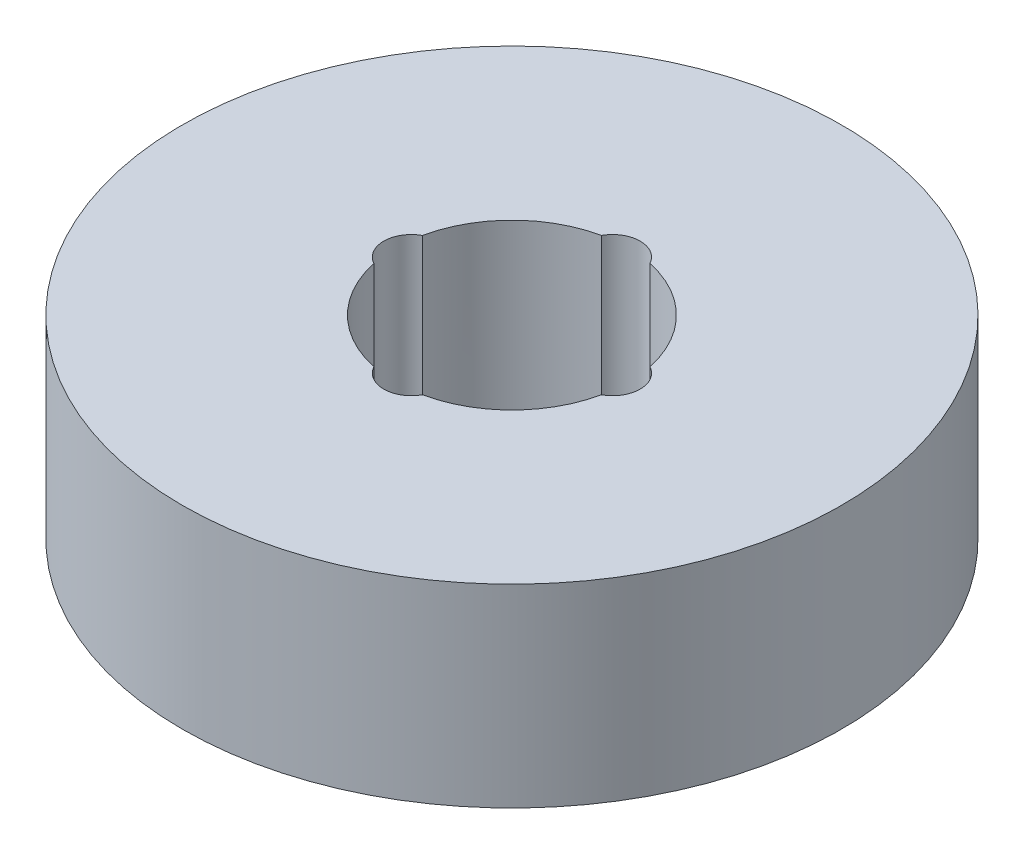
ISO-10303-21;
HEADER;
FILE_DESCRIPTION(('STEP AP214'),'2;1');
FILE_NAME('part.step','',(''),(''),'','','');
FILE_SCHEMA(('AUTOMOTIVE_DESIGN { 1 0 10303 214 1 1 1 1 }'));
ENDSEC;
DATA;
#1=APPLICATION_CONTEXT('core data for automotive mechanical design processes');
#2=APPLICATION_PROTOCOL_DEFINITION('international standard','automotive_design',2000,#1);
#3=PRODUCT_CONTEXT('',#1,'mechanical');
#4=PRODUCT('Part','Part','',(#3));
#5=PRODUCT_RELATED_PRODUCT_CATEGORY('part','',(#4));
#6=PRODUCT_DEFINITION_FORMATION('','',#4);
#7=PRODUCT_DEFINITION_CONTEXT('part definition',#1,'design');
#8=PRODUCT_DEFINITION('design','',#6,#7);
#9=PRODUCT_DEFINITION_SHAPE('','',#8);
#10=(LENGTH_UNIT() NAMED_UNIT(*) SI_UNIT(.MILLI.,.METRE.));
#11=(NAMED_UNIT(*) PLANE_ANGLE_UNIT() SI_UNIT($,.RADIAN.));
#12=(NAMED_UNIT(*) SI_UNIT($,.STERADIAN.) SOLID_ANGLE_UNIT());
#13=UNCERTAINTY_MEASURE_WITH_UNIT(LENGTH_MEASURE(1.E-05),#10,'distance_accuracy_value','');
#14=(GEOMETRIC_REPRESENTATION_CONTEXT(3) GLOBAL_UNCERTAINTY_ASSIGNED_CONTEXT((#13)) GLOBAL_UNIT_ASSIGNED_CONTEXT((#10,
#11,#12)) REPRESENTATION_CONTEXT('',''));
#15=CARTESIAN_POINT('',(0.,0.,0.));
#16=DIRECTION('',(0.,0.,1.));
#17=DIRECTION('',(1.,0.,0.));
#18=AXIS2_PLACEMENT_3D('',#15,#16,#17);
#19=CARTESIAN_POINT('',(0.,25.,0.));
#20=DIRECTION('',(0.,-1.,0.));
#21=DIRECTION('',(0.,0.,-1.));
#22=AXIS2_PLACEMENT_3D('',#19,#20,#21);
#23=CYLINDRICAL_SURFACE('',#22,42.5);
#24=CARTESIAN_POINT('',(0.,25.,0.));
#25=DIRECTION('',(0.,1.,0.));
#26=DIRECTION('',(0.,0.,1.));
#27=AXIS2_PLACEMENT_3D('',#24,#25,#26);
#28=CIRCLE('',#27,42.5);
#29=CARTESIAN_POINT('',(0.,25.,42.5));
#30=VERTEX_POINT('',#29);
#31=EDGE_CURVE('E148',#30,#30,#28,.T.);
#32=ORIENTED_EDGE('',*,*,#31,.F.);
#33=EDGE_LOOP('',(#32));
#34=FACE_BOUND('',#33,.T.);
#35=CARTESIAN_POINT('',(0.,0.,0.));
#36=DIRECTION('',(0.,1.,0.));
#37=DIRECTION('',(0.,0.,1.));
#38=AXIS2_PLACEMENT_3D('',#35,#36,#37);
#39=CIRCLE('',#38,42.5);
#40=CARTESIAN_POINT('',(0.,0.,42.5));
#41=VERTEX_POINT('',#40);
#42=EDGE_CURVE('E139',#41,#41,#39,.T.);
#43=ORIENTED_EDGE('',*,*,#42,.T.);
#44=EDGE_LOOP('',(#43));
#45=FACE_BOUND('',#44,.T.);
#46=ADVANCED_FACE('F39',(#34,#45),#23,.T.);
#47=CARTESIAN_POINT('',(0.,25.,0.));
#48=DIRECTION('',(0.,1.,0.));
#49=DIRECTION('',(0.,0.,1.));
#50=AXIS2_PLACEMENT_3D('',#47,#48,#49);
#51=PLANE('',#50);
#52=CARTESIAN_POINT('',(0.,25.,12.974475633163));
#53=DIRECTION('',(0.,1.,0.));
#54=DIRECTION('',(1.,0.,0.));
#55=AXIS2_PLACEMENT_3D('',#52,#53,#54);
#56=CIRCLE('',#55,3.55894624525557);
#57=CARTESIAN_POINT('',(-3.12910866637971,25.,14.6699924660508));
#58=VERTEX_POINT('',#57);
#59=CARTESIAN_POINT('',(3.12910866637982,25.,14.6699924660508));
#60=VERTEX_POINT('',#59);
#61=EDGE_CURVE('E175',#58,#60,#56,.T.);
#62=ORIENTED_EDGE('',*,*,#61,.F.);
#63=CARTESIAN_POINT('',(0.,25.,0.));
#64=DIRECTION('',(0.,1.,0.));
#65=DIRECTION('',(0.,0.,1.));
#66=AXIS2_PLACEMENT_3D('',#63,#64,#65);
#67=CIRCLE('',#66,15.);
#68=CARTESIAN_POINT('',(-14.6699924660508,25.,3.12910866637977));
#69=VERTEX_POINT('',#68);
#70=EDGE_CURVE('E134',#69,#58,#67,.T.);
#71=ORIENTED_EDGE('',*,*,#70,.F.);
#72=CARTESIAN_POINT('',(-12.974475633163,25.,0.));
#73=DIRECTION('',(0.,1.,0.));
#74=DIRECTION('',(0.,0.,1.));
#75=AXIS2_PLACEMENT_3D('',#72,#73,#74);
#76=CIRCLE('',#75,3.55894624525557);
#77=CARTESIAN_POINT('',(-14.6699924660508,25.,-3.12910866637977));
#78=VERTEX_POINT('',#77);
#79=EDGE_CURVE('E143',#78,#69,#76,.T.);
#80=ORIENTED_EDGE('',*,*,#79,.F.);
#81=CARTESIAN_POINT('',(-3.12910866637992,25.,-14.6699924660508));
#82=VERTEX_POINT('',#81);
#83=EDGE_CURVE('E123',#82,#78,#67,.T.);
#84=ORIENTED_EDGE('',*,*,#83,.F.);
#85=CARTESIAN_POINT('',(-1.35900418663391E-13,25.,-12.974475633163));
#86=DIRECTION('',(0.,1.,0.));
#87=DIRECTION('',(-1.,0.,0.));
#88=AXIS2_PLACEMENT_3D('',#85,#86,#87);
#89=CIRCLE('',#88,3.55894624525557);
#90=CARTESIAN_POINT('',(3.12910866637961,25.,-14.6699924660508));
#91=VERTEX_POINT('',#90);
#92=EDGE_CURVE('E106',#91,#82,#89,.T.);
#93=ORIENTED_EDGE('',*,*,#92,.F.);
#94=CARTESIAN_POINT('',(14.6699924660508,25.,-3.12910866637977));
#95=VERTEX_POINT('',#94);
#96=EDGE_CURVE('E125',#95,#91,#67,.T.);
#97=ORIENTED_EDGE('',*,*,#96,.F.);
#98=CARTESIAN_POINT('',(12.974475633163,25.,0.));
#99=DIRECTION('',(0.,1.,0.));
#100=DIRECTION('',(0.,0.,-1.));
#101=AXIS2_PLACEMENT_3D('',#98,#99,#100);
#102=CIRCLE('',#101,3.55894624525557);
#103=CARTESIAN_POINT('',(14.6699924660508,25.,3.12910866637977));
#104=VERTEX_POINT('',#103);
#105=EDGE_CURVE('E286',#104,#95,#102,.T.);
#106=ORIENTED_EDGE('',*,*,#105,.F.);
#107=EDGE_CURVE('E135',#60,#104,#67,.T.);
#108=ORIENTED_EDGE('',*,*,#107,.F.);
#109=EDGE_LOOP('',(#62,#71,#80,#84,#93,#97,#106,#108));
#110=FACE_BOUND('',#109,.T.);
#111=ORIENTED_EDGE('',*,*,#31,.T.);
#112=EDGE_LOOP('',(#111));
#113=FACE_BOUND('',#112,.T.);
#114=ADVANCED_FACE('F118',(#110,#113),#51,.T.);
#115=CARTESIAN_POINT('',(0.,0.,0.));
#116=DIRECTION('',(0.,1.,0.));
#117=DIRECTION('',(0.,0.,1.));
#118=AXIS2_PLACEMENT_3D('',#115,#116,#117);
#119=PLANE('',#118);
#120=CARTESIAN_POINT('',(0.,0.,0.));
#121=DIRECTION('',(0.,1.,0.));
#122=DIRECTION('',(0.,0.,1.));
#123=AXIS2_PLACEMENT_3D('',#120,#121,#122);
#124=CIRCLE('',#123,15.);
#125=CARTESIAN_POINT('',(0.,0.,15.));
#126=VERTEX_POINT('',#125);
#127=EDGE_CURVE('E136',#126,#126,#124,.T.);
#128=ORIENTED_EDGE('',*,*,#127,.T.);
#129=EDGE_LOOP('',(#128));
#130=FACE_BOUND('',#129,.T.);
#131=ORIENTED_EDGE('',*,*,#42,.F.);
#132=EDGE_LOOP('',(#131));
#133=FACE_BOUND('',#132,.T.);
#134=ADVANCED_FACE('F187',(#130,#133),#119,.F.);
#135=CARTESIAN_POINT('',(0.,25.,0.));
#136=DIRECTION('',(0.,-1.,0.));
#137=DIRECTION('',(0.,0.,-1.));
#138=AXIS2_PLACEMENT_3D('',#135,#136,#137);
#139=CYLINDRICAL_SURFACE('',#138,15.);
#140=DIRECTION('',(0.,1.,0.));
#141=VECTOR('',#140,1.);
#142=CARTESIAN_POINT('',(-3.12910866637971,13.7248972110217,14.6699924660508));
#143=LINE('',#142,#141);
#144=CARTESIAN_POINT('',(-3.12910866637971,2.44979442204347,14.6699924660508));
#145=VERTEX_POINT('',#144);
#146=EDGE_CURVE('E11',#145,#58,#143,.T.);
#147=ORIENTED_EDGE('',*,*,#146,.F.);
#148=CARTESIAN_POINT('',(0.,2.44979442204347,0.));
#149=DIRECTION('',(0.,1.,0.));
#150=DIRECTION('',(0.,0.,1.));
#151=AXIS2_PLACEMENT_3D('',#148,#149,#150);
#152=CIRCLE('',#151,15.);
#153=CARTESIAN_POINT('',(3.12910866637982,2.44979442204347,14.6699924660508));
#154=VERTEX_POINT('',#153);
#155=EDGE_CURVE('E170',#145,#154,#152,.T.);
#156=ORIENTED_EDGE('',*,*,#155,.T.);
#157=DIRECTION('',(0.,1.,0.));
#158=VECTOR('',#157,1.);
#159=CARTESIAN_POINT('',(3.12910866637982,13.7248972110217,14.6699924660508));
#160=LINE('',#159,#158);
#161=EDGE_CURVE('E46',#60,#154,#160,.F.);
#162=ORIENTED_EDGE('',*,*,#161,.F.);
#163=ORIENTED_EDGE('',*,*,#107,.T.);
#164=DIRECTION('',(0.,1.,0.));
#165=VECTOR('',#164,1.);
#166=CARTESIAN_POINT('',(14.6699924660508,13.7248972110217,3.12910866637977));
#167=LINE('',#166,#165);
#168=CARTESIAN_POINT('',(14.6699924660508,2.44979442204347,3.12910866637977));
#169=VERTEX_POINT('',#168);
#170=EDGE_CURVE('E164',#169,#104,#167,.T.);
#171=ORIENTED_EDGE('',*,*,#170,.F.);
#172=CARTESIAN_POINT('',(0.,2.44979442204347,0.));
#173=DIRECTION('',(0.,1.,0.));
#174=DIRECTION('',(0.,0.,1.));
#175=AXIS2_PLACEMENT_3D('',#172,#173,#174);
#176=CIRCLE('',#175,15.);
#177=CARTESIAN_POINT('',(14.6699924660508,2.44979442204347,-3.12910866637977));
#178=VERTEX_POINT('',#177);
#179=EDGE_CURVE('E115',#169,#178,#176,.T.);
#180=ORIENTED_EDGE('',*,*,#179,.T.);
#181=DIRECTION('',(0.,1.,0.));
#182=VECTOR('',#181,1.);
#183=CARTESIAN_POINT('',(14.6699924660508,13.7248972110217,-3.12910866637977));
#184=LINE('',#183,#182);
#185=EDGE_CURVE('E131',#95,#178,#184,.F.);
#186=ORIENTED_EDGE('',*,*,#185,.F.);
#187=ORIENTED_EDGE('',*,*,#96,.T.);
#188=DIRECTION('',(0.,1.,0.));
#189=VECTOR('',#188,1.);
#190=CARTESIAN_POINT('',(3.12910866637961,13.7248972110217,-14.6699924660508));
#191=LINE('',#190,#189);
#192=CARTESIAN_POINT('',(3.12910866637961,2.44979442204347,-14.6699924660508));
#193=VERTEX_POINT('',#192);
#194=EDGE_CURVE('E105',#193,#91,#191,.T.);
#195=ORIENTED_EDGE('',*,*,#194,.F.);
#196=CARTESIAN_POINT('',(0.,2.44979442204347,0.));
#197=DIRECTION('',(0.,1.,0.));
#198=DIRECTION('',(0.,0.,1.));
#199=AXIS2_PLACEMENT_3D('',#196,#197,#198);
#200=CIRCLE('',#199,15.);
#201=CARTESIAN_POINT('',(-3.12910866637992,2.44979442204347,-14.6699924660508));
#202=VERTEX_POINT('',#201);
#203=EDGE_CURVE('E159',#193,#202,#200,.T.);
#204=ORIENTED_EDGE('',*,*,#203,.T.);
#205=DIRECTION('',(0.,1.,0.));
#206=VECTOR('',#205,1.);
#207=CARTESIAN_POINT('',(-3.12910866637992,13.7248972110217,-14.6699924660508));
#208=LINE('',#207,#206);
#209=EDGE_CURVE('E114',#82,#202,#208,.F.);
#210=ORIENTED_EDGE('',*,*,#209,.F.);
#211=ORIENTED_EDGE('',*,*,#83,.T.);
#212=DIRECTION('',(0.,1.,0.));
#213=VECTOR('',#212,1.);
#214=CARTESIAN_POINT('',(-14.6699924660508,13.7248972110217,-3.12910866637977));
#215=LINE('',#214,#213);
#216=CARTESIAN_POINT('',(-14.6699924660508,2.44979442204347,-3.12910866637977));
#217=VERTEX_POINT('',#216);
#218=EDGE_CURVE('E160',#217,#78,#215,.T.);
#219=ORIENTED_EDGE('',*,*,#218,.F.);
#220=CARTESIAN_POINT('',(0.,2.44979442204347,0.));
#221=DIRECTION('',(0.,1.,0.));
#222=DIRECTION('',(0.,0.,1.));
#223=AXIS2_PLACEMENT_3D('',#220,#221,#222);
#224=CIRCLE('',#223,15.);
#225=CARTESIAN_POINT('',(-14.6699924660508,2.44979442204347,3.12910866637977));
#226=VERTEX_POINT('',#225);
#227=EDGE_CURVE('E149',#217,#226,#224,.T.);
#228=ORIENTED_EDGE('',*,*,#227,.T.);
#229=DIRECTION('',(0.,1.,0.));
#230=VECTOR('',#229,1.);
#231=CARTESIAN_POINT('',(-14.6699924660508,13.7248972110217,3.12910866637977));
#232=LINE('',#231,#230);
#233=EDGE_CURVE('E152',#69,#226,#232,.F.);
#234=ORIENTED_EDGE('',*,*,#233,.F.);
#235=ORIENTED_EDGE('',*,*,#70,.T.);
#236=EDGE_LOOP('',(#147,#156,#162,#163,#171,#180,#186,#187,#195,#204,#210,#211,#219,#228,#234,#235));
#237=FACE_BOUND('',#236,.T.);
#238=ORIENTED_EDGE('',*,*,#127,.F.);
#239=EDGE_LOOP('',(#238));
#240=FACE_BOUND('',#239,.T.);
#241=ADVANCED_FACE('F126',(#237,#240),#139,.F.);
#242=CARTESIAN_POINT('',(-12.974475633163,2.44979442204347,0.));
#243=DIRECTION('',(0.,1.,0.));
#244=DIRECTION('',(0.,0.,1.));
#245=AXIS2_PLACEMENT_3D('',#242,#243,#244);
#246=CYLINDRICAL_SURFACE('',#245,3.55894624525557);
#247=ORIENTED_EDGE('',*,*,#218,.T.);
#248=ORIENTED_EDGE('',*,*,#79,.T.);
#249=ORIENTED_EDGE('',*,*,#233,.T.);
#250=CARTESIAN_POINT('',(-12.974475633163,2.44979442204347,0.));
#251=DIRECTION('',(0.,1.,0.));
#252=DIRECTION('',(0.,0.,1.));
#253=AXIS2_PLACEMENT_3D('',#250,#251,#252);
#254=CIRCLE('',#253,3.55894624525557);
#255=EDGE_CURVE('E144',#217,#226,#254,.T.);
#256=ORIENTED_EDGE('',*,*,#255,.F.);
#257=EDGE_LOOP('',(#247,#248,#249,#256));
#258=FACE_BOUND('',#257,.T.);
#259=ADVANCED_FACE('F200',(#258),#246,.F.);
#260=CARTESIAN_POINT('',(-12.974475633163,2.44979442204347,0.));
#261=DIRECTION('',(0.,1.,0.));
#262=DIRECTION('',(0.,0.,1.));
#263=AXIS2_PLACEMENT_3D('',#260,#261,#262);
#264=PLANE('',#263);
#265=ORIENTED_EDGE('',*,*,#255,.T.);
#266=ORIENTED_EDGE('',*,*,#227,.F.);
#267=EDGE_LOOP('',(#265,#266));
#268=FACE_BOUND('',#267,.T.);
#269=ADVANCED_FACE('F201',(#268),#264,.T.);
#270=CARTESIAN_POINT('',(-1.35900418663391E-13,2.44979442204347,-12.974475633163));
#271=DIRECTION('',(0.,1.,0.));
#272=DIRECTION('',(0.,0.,1.));
#273=AXIS2_PLACEMENT_3D('',#270,#271,#272);
#274=CYLINDRICAL_SURFACE('',#273,3.55894624525557);
#275=ORIENTED_EDGE('',*,*,#194,.T.);
#276=ORIENTED_EDGE('',*,*,#92,.T.);
#277=ORIENTED_EDGE('',*,*,#209,.T.);
#278=CARTESIAN_POINT('',(-1.35900418663391E-13,2.44979442204347,-12.974475633163));
#279=DIRECTION('',(0.,1.,0.));
#280=DIRECTION('',(-1.,0.,0.));
#281=AXIS2_PLACEMENT_3D('',#278,#279,#280);
#282=CIRCLE('',#281,3.55894624525557);
#283=EDGE_CURVE('E107',#193,#202,#282,.T.);
#284=ORIENTED_EDGE('',*,*,#283,.F.);
#285=EDGE_LOOP('',(#275,#276,#277,#284));
#286=FACE_BOUND('',#285,.T.);
#287=ADVANCED_FACE('F102',(#286),#274,.F.);
#288=CARTESIAN_POINT('',(-1.35900418663391E-13,2.44979442204347,-12.974475633163));
#289=DIRECTION('',(0.,1.,0.));
#290=DIRECTION('',(-1.,0.,0.));
#291=AXIS2_PLACEMENT_3D('',#288,#289,#290);
#292=PLANE('',#291);
#293=ORIENTED_EDGE('',*,*,#283,.T.);
#294=ORIENTED_EDGE('',*,*,#203,.F.);
#295=EDGE_LOOP('',(#293,#294));
#296=FACE_BOUND('',#295,.T.);
#297=ADVANCED_FACE('F209',(#296),#292,.T.);
#298=CARTESIAN_POINT('',(12.974475633163,2.44979442204347,0.));
#299=DIRECTION('',(0.,1.,0.));
#300=DIRECTION('',(0.,0.,1.));
#301=AXIS2_PLACEMENT_3D('',#298,#299,#300);
#302=CYLINDRICAL_SURFACE('',#301,3.55894624525557);
#303=ORIENTED_EDGE('',*,*,#170,.T.);
#304=ORIENTED_EDGE('',*,*,#105,.T.);
#305=ORIENTED_EDGE('',*,*,#185,.T.);
#306=CARTESIAN_POINT('',(12.974475633163,2.44979442204347,0.));
#307=DIRECTION('',(0.,1.,0.));
#308=DIRECTION('',(0.,0.,-1.));
#309=AXIS2_PLACEMENT_3D('',#306,#307,#308);
#310=CIRCLE('',#309,3.55894624525557);
#311=EDGE_CURVE('E56',#169,#178,#310,.T.);
#312=ORIENTED_EDGE('',*,*,#311,.F.);
#313=EDGE_LOOP('',(#303,#304,#305,#312));
#314=FACE_BOUND('',#313,.T.);
#315=ADVANCED_FACE('F213',(#314),#302,.F.);
#316=CARTESIAN_POINT('',(12.974475633163,2.44979442204347,0.));
#317=DIRECTION('',(0.,1.,0.));
#318=DIRECTION('',(0.,0.,-1.));
#319=AXIS2_PLACEMENT_3D('',#316,#317,#318);
#320=PLANE('',#319);
#321=ORIENTED_EDGE('',*,*,#311,.T.);
#322=ORIENTED_EDGE('',*,*,#179,.F.);
#323=EDGE_LOOP('',(#321,#322));
#324=FACE_BOUND('',#323,.T.);
#325=ADVANCED_FACE('F179',(#324),#320,.T.);
#326=CARTESIAN_POINT('',(0.,2.44979442204347,12.974475633163));
#327=DIRECTION('',(0.,1.,0.));
#328=DIRECTION('',(0.,0.,1.));
#329=AXIS2_PLACEMENT_3D('',#326,#327,#328);
#330=CYLINDRICAL_SURFACE('',#329,3.55894624525557);
#331=ORIENTED_EDGE('',*,*,#146,.T.);
#332=ORIENTED_EDGE('',*,*,#61,.T.);
#333=ORIENTED_EDGE('',*,*,#161,.T.);
#334=CARTESIAN_POINT('',(0.,2.44979442204347,12.974475633163));
#335=DIRECTION('',(0.,1.,0.));
#336=DIRECTION('',(1.,0.,0.));
#337=AXIS2_PLACEMENT_3D('',#334,#335,#336);
#338=CIRCLE('',#337,3.55894624525557);
#339=EDGE_CURVE('E55',#145,#154,#338,.T.);
#340=ORIENTED_EDGE('',*,*,#339,.F.);
#341=EDGE_LOOP('',(#331,#332,#333,#340));
#342=FACE_BOUND('',#341,.T.);
#343=ADVANCED_FACE('F171',(#342),#330,.F.);
#344=CARTESIAN_POINT('',(0.,2.44979442204347,12.974475633163));
#345=DIRECTION('',(0.,1.,0.));
#346=DIRECTION('',(1.,0.,0.));
#347=AXIS2_PLACEMENT_3D('',#344,#345,#346);
#348=PLANE('',#347);
#349=ORIENTED_EDGE('',*,*,#339,.T.);
#350=ORIENTED_EDGE('',*,*,#155,.F.);
#351=EDGE_LOOP('',(#349,#350));
#352=FACE_BOUND('',#351,.T.);
#353=ADVANCED_FACE('F173',(#352),#348,.T.);
#354=CLOSED_SHELL('',(#46,#114,#134,#241,#259,#269,#287,#297,#315,#325,#343,#353));
#355=MANIFOLD_SOLID_BREP('B2',#354);
#356=ADVANCED_BREP_SHAPE_REPRESENTATION('',(#18,#355),#14);
#357=SHAPE_DEFINITION_REPRESENTATION(#9,#356);
ENDSEC;
END-ISO-10303-21;
